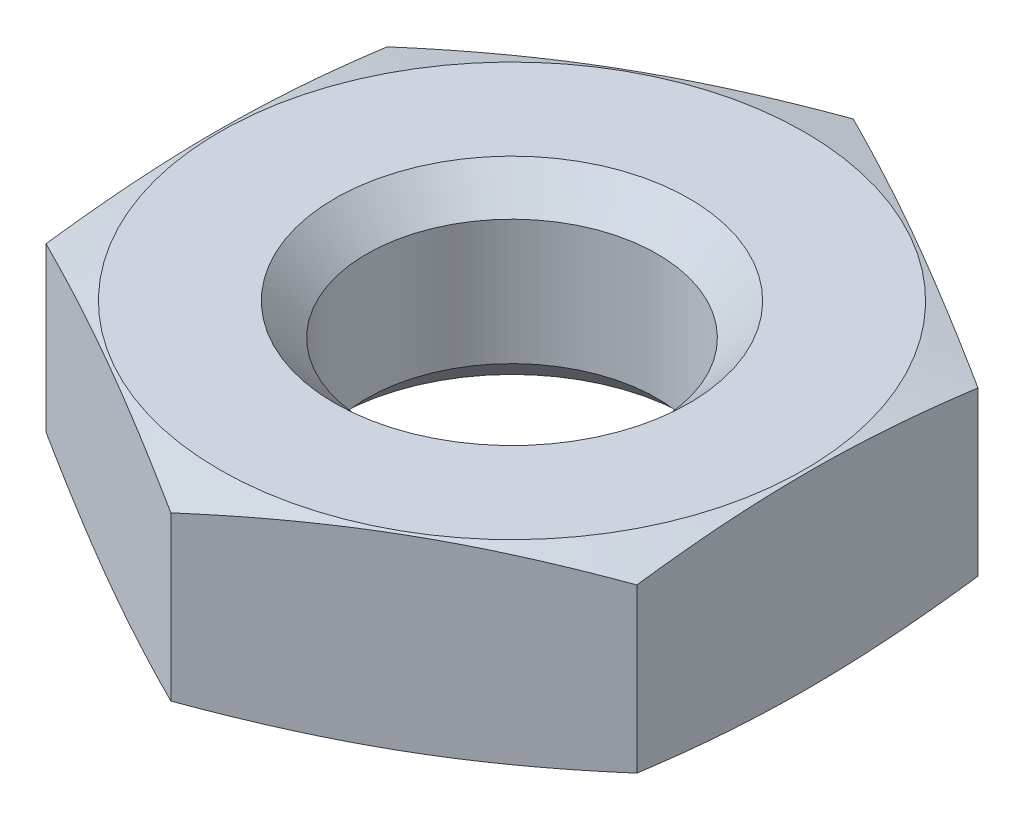
ISO-10303-21;
HEADER;
FILE_DESCRIPTION(('STEP AP214'),'2;1');
FILE_NAME('part.step','',(''),(''),'','','');
FILE_SCHEMA(('AUTOMOTIVE_DESIGN { 1 0 10303 214 1 1 1 1 }'));
ENDSEC;
DATA;
#1=APPLICATION_CONTEXT('core data for automotive mechanical design processes');
#2=APPLICATION_PROTOCOL_DEFINITION('international standard','automotive_design',2000,#1);
#3=PRODUCT_CONTEXT('',#1,'mechanical');
#4=PRODUCT('Part','Part','',(#3));
#5=PRODUCT_RELATED_PRODUCT_CATEGORY('part','',(#4));
#6=PRODUCT_DEFINITION_FORMATION('','',#4);
#7=PRODUCT_DEFINITION_CONTEXT('part definition',#1,'design');
#8=PRODUCT_DEFINITION('design','',#6,#7);
#9=PRODUCT_DEFINITION_SHAPE('','',#8);
#10=(LENGTH_UNIT() NAMED_UNIT(*) SI_UNIT(.MILLI.,.METRE.));
#11=(NAMED_UNIT(*) PLANE_ANGLE_UNIT() SI_UNIT($,.RADIAN.));
#12=(NAMED_UNIT(*) SI_UNIT($,.STERADIAN.) SOLID_ANGLE_UNIT());
#13=UNCERTAINTY_MEASURE_WITH_UNIT(LENGTH_MEASURE(1.E-05),#10,'distance_accuracy_value','');
#14=(GEOMETRIC_REPRESENTATION_CONTEXT(3) GLOBAL_UNCERTAINTY_ASSIGNED_CONTEXT((#13)) GLOBAL_UNIT_ASSIGNED_CONTEXT((#10,
#11,#12)) REPRESENTATION_CONTEXT('',''));
#15=CARTESIAN_POINT('',(0.,0.,0.));
#16=DIRECTION('',(0.,0.,1.));
#17=DIRECTION('',(1.,0.,0.));
#18=AXIS2_PLACEMENT_3D('',#15,#16,#17);
#19=CARTESIAN_POINT('',(0.,0.,0.));
#20=DIRECTION('',(0.,1.,0.));
#21=DIRECTION('',(0.,0.,1.));
#22=AXIS2_PLACEMENT_3D('',#19,#20,#21);
#23=PLANE('',#22);
#24=CARTESIAN_POINT('',(0.,0.,0.));
#25=DIRECTION('',(0.,1.,0.));
#26=DIRECTION('',(0.,0.,1.));
#27=AXIS2_PLACEMENT_3D('',#24,#25,#26);
#28=CIRCLE('',#27,3.);
#29=CARTESIAN_POINT('',(0.,0.,3.));
#30=VERTEX_POINT('',#29);
#31=EDGE_CURVE('E104',#30,#30,#28,.T.);
#32=ORIENTED_EDGE('',*,*,#31,.F.);
#33=EDGE_LOOP('',(#32));
#34=FACE_BOUND('',#33,.T.);
#35=CARTESIAN_POINT('',(0.,0.,0.));
#36=DIRECTION('',(0.,-1.,0.));
#37=DIRECTION('',(0.,0.,-1.));
#38=AXIS2_PLACEMENT_3D('',#35,#36,#37);
#39=CIRCLE('',#38,4.95);
#40=CARTESIAN_POINT('',(0.,0.,-4.95));
#41=VERTEX_POINT('',#40);
#42=EDGE_CURVE('E95',#41,#41,#39,.T.);
#43=ORIENTED_EDGE('',*,*,#42,.F.);
#44=EDGE_LOOP('',(#43));
#45=FACE_BOUND('',#44,.T.);
#46=ADVANCED_FACE('F35',(#34,#45),#23,.T.);
#47=CARTESIAN_POINT('',(0.,-1.6,0.));
#48=DIRECTION('',(0.,-1.,0.));
#49=DIRECTION('',(0.,0.,-1.));
#50=AXIS2_PLACEMENT_3D('',#47,#48,#49);
#51=CONICAL_SURFACE('',#50,10.9212812921102,1.30899693899575);
#52=CARTESIAN_POINT('',(-5.,-1.40384045121828,8.87805586292439));
#53=CARTESIAN_POINT('',(-5.,-1.35391797525742,8.66419967998421));
#54=CARTESIAN_POINT('',(-5.,-1.30439543780652,8.45024946734596));
#55=CARTESIAN_POINT('',(-5.,-1.20633084662231,8.02212108338699));
#56=CARTESIAN_POINT('',(-5.,-1.15778880821914,7.80794290855711));
#57=CARTESIAN_POINT('',(-5.,-1.0618587798065,7.37928689321625));
#58=CARTESIAN_POINT('',(-5.,-1.01447099861738,7.16480900579625));
#59=CARTESIAN_POINT('',(-5.,-0.92110454168024,6.73554876389549));
#60=CARTESIAN_POINT('',(-5.,-0.875125861507366,6.52076641037302));
#61=CARTESIAN_POINT('',(-5.,-0.738830474842199,5.87168350632895));
#62=CARTESIAN_POINT('',(-5.,-0.651101139562341,5.43682759426054));
#63=CARTESIAN_POINT('',(-5.,-0.527234018952879,4.78304799504558));
#64=CARTESIAN_POINT('',(-5.,-0.48723027981153,4.56485695124602));
#65=CARTESIAN_POINT('',(-5.,-0.410417596666629,4.12791523501558));
#66=CARTESIAN_POINT('',(-5.,-0.373608568199298,3.90916457753763));
#67=CARTESIAN_POINT('',(-5.,-0.304856947723479,3.477061393467));
#68=CARTESIAN_POINT('',(-5.,-0.272808368510456,3.26372584152725));
#69=CARTESIAN_POINT('',(-5.,-0.213182881264414,2.83642164400753));
#70=CARTESIAN_POINT('',(-5.,-0.18560604037634,2.62245298897036));
#71=CARTESIAN_POINT('',(-5.,-0.135784090940788,2.19394231946795));
#72=CARTESIAN_POINT('',(-5.,-0.113537665546939,1.97940045987965));
#73=CARTESIAN_POINT('',(-5.,-0.0752280510190547,1.54977294154379));
#74=CARTESIAN_POINT('',(-5.,-0.0591644215455117,1.33468732262148));
#75=CARTESIAN_POINT('',(-5.,-0.0340170523392007,0.905077197521867));
#76=CARTESIAN_POINT('',(-5.,-0.0249020985371091,0.690554548014879));
#77=CARTESIAN_POINT('',(-5.,-0.0140044500352038,0.261321216211934));
#78=CARTESIAN_POINT('',(-5.,-0.0122217093359192,0.0466105351040659));
#79=CARTESIAN_POINT('',(-5.,-0.0160866220181523,-0.382757110763415));
#80=CARTESIAN_POINT('',(-5.,-0.0217347557175591,-0.597414071153564));
#81=CARTESIAN_POINT('',(-5.,-0.0401569999047294,-1.02641477561922));
#82=CARTESIAN_POINT('',(-5.,-0.0529311113199373,-1.24075851965396));
#83=CARTESIAN_POINT('',(-5.,-0.0921734050345291,-1.76492980573846));
#84=CARTESIAN_POINT('',(-5.,-0.122213283058432,-2.0744900323219));
#85=CARTESIAN_POINT('',(-5.,-0.193430880028108,-2.69227880880446));
#86=CARTESIAN_POINT('',(-5.,-0.234608339742622,-3.0005073895285));
#87=CARTESIAN_POINT('',(-5.,-0.325711024028119,-3.61670104233183));
#88=CARTESIAN_POINT('',(-5.,-0.375665000650182,-3.92466179749607));
#89=CARTESIAN_POINT('',(-5.,-0.482092583837901,-4.53945702482084));
#90=CARTESIAN_POINT('',(-5.,-0.538566529999179,-4.84629143745569));
#91=CARTESIAN_POINT('',(-5.,-0.657638370362325,-5.46550091451042));
#92=CARTESIAN_POINT('',(-5.,-0.720340599855474,-5.77785575853689));
#93=CARTESIAN_POINT('',(-5.,-0.849551314942411,-6.40177665533053));
#94=CARTESIAN_POINT('',(-5.,-0.91605984784295,-6.71334269824377));
#95=CARTESIAN_POINT('',(-5.,-1.05155633698141,-7.33405736567034));
#96=CARTESIAN_POINT('',(-5.,-1.12052785519265,-7.64320959550048));
#97=CARTESIAN_POINT('',(-5.,-1.26068096907521,-8.26099002626834));
#98=CARTESIAN_POINT('',(-5.,-1.33186240507047,-8.56961826337515));
#99=CARTESIAN_POINT('',(-5.,-1.40384045121828,-8.87805586292439));
#100=B_SPLINE_CURVE_WITH_KNOTS('',3,(#52,#53,#54,#55,#56,#57,#58,#59,#60,#61,#62,#63,#64,#65,
#66,#67,#68,#69,#70,#71,#72,#73,#74,#75,#76,#77,#78,#79,#80,#81,#82,#83,#84,#85,#86,#87,#88,#89,
#90,#91,#92,#93,#94,#95,#96,#97,#98,#99),.UNSPECIFIED.,.F.,.F.,(4,2,2,2,2,2,2,2,2,2,2,2,2,2,2,2,
2,2,2,2,2,2,2,4),(0.,0.658817958258114,1.31764620921149,1.9765927786871,2.63553727873193,
3.96628445730603,4.63175058893382,5.29719912118488,5.94434851429525,6.59150762371396,
7.23850669123405,7.88545967086849,8.52948907105178,9.17351443083736,9.81758142126871,
10.4616484955253,11.3944203328512,12.3271704614417,13.2630353012496,14.1989489080193,
15.1546761010961,16.1104151750364,17.060663933496,18.0108441914634),.UNSPECIFIED.);
#101=CARTESIAN_POINT('',(-5.,-0.220656881258457,2.88675134594813));
#102=VERTEX_POINT('',#101);
#103=CARTESIAN_POINT('',(-5.,-0.220656881258458,-2.88675134594813));
#104=VERTEX_POINT('',#103);
#105=EDGE_CURVE('E102',#102,#104,#100,.T.);
#106=ORIENTED_EDGE('',*,*,#105,.F.);
#107=CARTESIAN_POINT('',(0.000200000000000026,-0.220687822294318,5.7736181619501));
#108=CARTESIAN_POINT('',(-0.207454004305664,-0.188549555804564,5.65372906666592));
#109=CARTESIAN_POINT('',(-0.415484518325707,-0.159373272644995,5.53362259339679));
#110=CARTESIAN_POINT('',(-0.832280248969818,-0.108113229801612,5.29298546611233));
#111=CARTESIAN_POINT('',(-1.04104572932974,-0.0860323511907198,5.17245465982903));
#112=CARTESIAN_POINT('',(-1.45804559853969,-0.0502522274677517,4.93169967308862));
#113=CARTESIAN_POINT('',(-1.66627716741308,-0.0365103114883428,4.81147712074579));
#114=CARTESIAN_POINT('',(-2.08300586365708,-0.0180838038255036,4.57087869579027));
#115=CARTESIAN_POINT('',(-2.29150293182854,-0.013397459621556,4.45050285735623));
#116=CARTESIAN_POINT('',(-2.70849706817146,-0.0133974596215561,4.20975118048816));
#117=CARTESIAN_POINT('',(-2.91699413634291,-0.0180838038255036,4.08937534205412));
#118=CARTESIAN_POINT('',(-3.33372283258692,-0.0365103114883427,3.8487769170986));
#119=CARTESIAN_POINT('',(-3.54195440146031,-0.0502522274677514,3.72855436475577));
#120=CARTESIAN_POINT('',(-3.95895427067026,-0.0860323511907194,3.48779937801536));
#121=CARTESIAN_POINT('',(-4.16771975103018,-0.108113229801611,3.36726857173206));
#122=CARTESIAN_POINT('',(-4.58451548167429,-0.159373272644995,3.1266314444476));
#123=CARTESIAN_POINT('',(-4.79254599569433,-0.188549555804563,3.00652497117847));
#124=CARTESIAN_POINT('',(-5.0002,-0.220687822294318,2.88663587589429));
#125=B_SPLINE_CURVE_WITH_KNOTS('',3,(#107,#108,#109,#110,#111,#112,#113,#114,#115,#116,#117,
#118,#119,#120,#121,#122,#123,#124),.UNSPECIFIED.,.F.,.F.,(4,2,2,2,2,2,2,2,4),(0.,
0.725805237679808,1.45190481561532,2.17425686883392,2.89646911159516,3.6186813543564,
4.34103340757501,5.06713298551051,5.79293822319032),.UNSPECIFIED.);
#126=CARTESIAN_POINT('',(0.,-0.220656881258458,5.77350269189626));
#127=VERTEX_POINT('',#126);
#128=EDGE_CURVE('E139',#127,#102,#125,.T.);
#129=ORIENTED_EDGE('',*,*,#128,.F.);
#130=CARTESIAN_POINT('',(5.0002,-0.220687822294318,2.88663587589429));
#131=CARTESIAN_POINT('',(4.79254599569433,-0.188549555804564,3.00652497117847));
#132=CARTESIAN_POINT('',(4.58451548167429,-0.159373272644995,3.1266314444476));
#133=CARTESIAN_POINT('',(4.16771975103018,-0.108113229801611,3.36726857173206));
#134=CARTESIAN_POINT('',(3.95895427067026,-0.0860323511907194,3.48779937801536));
#135=CARTESIAN_POINT('',(3.54195440146031,-0.0502522274677513,3.72855436475577));
#136=CARTESIAN_POINT('',(3.33372283258692,-0.0365103114883428,3.8487769170986));
#137=CARTESIAN_POINT('',(2.91699413634292,-0.0180838038255038,4.08937534205412));
#138=CARTESIAN_POINT('',(2.70849706817146,-0.0133974596215563,4.20975118048816));
#139=CARTESIAN_POINT('',(2.29150293182854,-0.0133974596215562,4.45050285735623));
#140=CARTESIAN_POINT('',(2.08300586365709,-0.0180838038255036,4.57087869579027));
#141=CARTESIAN_POINT('',(1.66627716741308,-0.0365103114883428,4.81147712074579));
#142=CARTESIAN_POINT('',(1.45804559853969,-0.0502522274677516,4.93169967308862));
#143=CARTESIAN_POINT('',(1.04104572932974,-0.0860323511907198,5.17245465982902));
#144=CARTESIAN_POINT('',(0.832280248969819,-0.108113229801611,5.29298546611233));
#145=CARTESIAN_POINT('',(0.415484518325709,-0.159373272644995,5.53362259339679));
#146=CARTESIAN_POINT('',(0.207454004305666,-0.188549555804564,5.65372906666592));
#147=CARTESIAN_POINT('',(-0.000199999999999064,-0.220687822294318,5.7736181619501));
#148=B_SPLINE_CURVE_WITH_KNOTS('',3,(#130,#131,#132,#133,#134,#135,#136,#137,#138,#139,#140,
#141,#142,#143,#144,#145,#146,#147),.UNSPECIFIED.,.F.,.F.,(4,2,2,2,2,2,2,2,4),(0.,
0.725805237679808,1.45190481561532,2.17425686883392,2.89646911159516,3.6186813543564,
4.34103340757501,5.06713298551051,5.79293822319032),.UNSPECIFIED.);
#149=CARTESIAN_POINT('',(5.,-0.220656881258457,2.88675134594813));
#150=VERTEX_POINT('',#149);
#151=EDGE_CURVE('E146',#150,#127,#148,.T.);
#152=ORIENTED_EDGE('',*,*,#151,.F.);
#153=CARTESIAN_POINT('',(5.,-1.40384045121828,-8.87805586292439));
#154=CARTESIAN_POINT('',(5.,-1.35391797525742,-8.66419967998421));
#155=CARTESIAN_POINT('',(5.,-1.30439543780652,-8.45024946734596));
#156=CARTESIAN_POINT('',(5.,-1.20633084662231,-8.02212108338699));
#157=CARTESIAN_POINT('',(5.,-1.15778880821914,-7.80794290855711));
#158=CARTESIAN_POINT('',(5.,-1.0618587798065,-7.37928689321625));
#159=CARTESIAN_POINT('',(5.,-1.01447099861738,-7.16480900579625));
#160=CARTESIAN_POINT('',(5.,-0.92110454168024,-6.73554876389549));
#161=CARTESIAN_POINT('',(5.,-0.875125861507366,-6.52076641037302));
#162=CARTESIAN_POINT('',(5.,-0.738830474842199,-5.87168350632895));
#163=CARTESIAN_POINT('',(5.,-0.651101139562341,-5.43682759426054));
#164=CARTESIAN_POINT('',(5.,-0.527234018952879,-4.78304799504558));
#165=CARTESIAN_POINT('',(5.,-0.48723027981153,-4.56485695124602));
#166=CARTESIAN_POINT('',(5.,-0.410417596666629,-4.12791523501558));
#167=CARTESIAN_POINT('',(5.,-0.373608568199298,-3.90916457753763));
#168=CARTESIAN_POINT('',(5.,-0.304856947723479,-3.477061393467));
#169=CARTESIAN_POINT('',(5.,-0.272808368510456,-3.26372584152725));
#170=CARTESIAN_POINT('',(5.,-0.213182881264414,-2.83642164400753));
#171=CARTESIAN_POINT('',(5.,-0.18560604037634,-2.62245298897036));
#172=CARTESIAN_POINT('',(5.,-0.135784090940788,-2.19394231946795));
#173=CARTESIAN_POINT('',(5.,-0.113537665546939,-1.97940045987965));
#174=CARTESIAN_POINT('',(5.,-0.0752280510190547,-1.54977294154379));
#175=CARTESIAN_POINT('',(5.,-0.0591644215455117,-1.33468732262148));
#176=CARTESIAN_POINT('',(5.,-0.0340170523392007,-0.905077197521867));
#177=CARTESIAN_POINT('',(5.,-0.0249020985371091,-0.690554548014879));
#178=CARTESIAN_POINT('',(5.,-0.0140044500352038,-0.261321216211934));
#179=CARTESIAN_POINT('',(5.,-0.0122217093359192,-0.0466105351040659));
#180=CARTESIAN_POINT('',(5.,-0.0160866220181523,0.382757110763415));
#181=CARTESIAN_POINT('',(5.,-0.0217347557175591,0.597414071153564));
#182=CARTESIAN_POINT('',(5.,-0.0401569999047294,1.02641477561922));
#183=CARTESIAN_POINT('',(5.,-0.0529311113199373,1.24075851965396));
#184=CARTESIAN_POINT('',(5.,-0.0921734050345291,1.76492980573846));
#185=CARTESIAN_POINT('',(5.,-0.122213283058432,2.0744900323219));
#186=CARTESIAN_POINT('',(5.,-0.193430880028108,2.69227880880446));
#187=CARTESIAN_POINT('',(5.,-0.234608339742622,3.0005073895285));
#188=CARTESIAN_POINT('',(5.,-0.325711024028119,3.61670104233183));
#189=CARTESIAN_POINT('',(5.,-0.375665000650182,3.92466179749607));
#190=CARTESIAN_POINT('',(5.,-0.482092583837901,4.53945702482084));
#191=CARTESIAN_POINT('',(5.,-0.538566529999179,4.84629143745569));
#192=CARTESIAN_POINT('',(5.,-0.657638370362325,5.46550091451042));
#193=CARTESIAN_POINT('',(5.,-0.720340599855474,5.77785575853689));
#194=CARTESIAN_POINT('',(5.,-0.849551314942411,6.40177665533053));
#195=CARTESIAN_POINT('',(5.,-0.91605984784295,6.71334269824377));
#196=CARTESIAN_POINT('',(5.,-1.05155633698141,7.33405736567034));
#197=CARTESIAN_POINT('',(5.,-1.12052785519265,7.64320959550048));
#198=CARTESIAN_POINT('',(5.,-1.26068096907521,8.26099002626834));
#199=CARTESIAN_POINT('',(5.,-1.33186240507047,8.56961826337515));
#200=CARTESIAN_POINT('',(5.,-1.40384045121828,8.87805586292439));
#201=B_SPLINE_CURVE_WITH_KNOTS('',3,(#153,#154,#155,#156,#157,#158,#159,#160,#161,#162,#163,
#164,#165,#166,#167,#168,#169,#170,#171,#172,#173,#174,#175,#176,#177,#178,#179,#180,#181,#182,
#183,#184,#185,#186,#187,#188,#189,#190,#191,#192,#193,#194,#195,#196,#197,#198,#199,#200),
.UNSPECIFIED.,.F.,.F.,(4,2,2,2,2,2,2,2,2,2,2,2,2,2,2,2,2,2,2,2,2,2,2,4),(0.,0.658817958258114,
1.31764620921149,1.9765927786871,2.63553727873193,3.96628445730603,4.63175058893382,
5.29719912118488,5.94434851429525,6.59150762371396,7.23850669123405,7.88545967086849,
8.52948907105178,9.17351443083736,9.81758142126871,10.4616484955253,11.3944203328512,
12.3271704614417,13.2630353012496,14.1989489080193,15.1546761010961,16.1104151750364,
17.060663933496,18.0108441914634),.UNSPECIFIED.);
#202=CARTESIAN_POINT('',(5.,-0.220656881258457,-2.88675134594813));
#203=VERTEX_POINT('',#202);
#204=EDGE_CURVE('E181',#203,#150,#201,.T.);
#205=ORIENTED_EDGE('',*,*,#204,.F.);
#206=CARTESIAN_POINT('',(-0.000200000000000026,-0.220687822294318,-5.7736181619501));
#207=CARTESIAN_POINT('',(0.207454004305664,-0.188549555804564,-5.65372906666592));
#208=CARTESIAN_POINT('',(0.415484518325707,-0.159373272644995,-5.53362259339679));
#209=CARTESIAN_POINT('',(0.832280248969818,-0.108113229801612,-5.29298546611233));
#210=CARTESIAN_POINT('',(1.04104572932974,-0.0860323511907198,-5.17245465982903));
#211=CARTESIAN_POINT('',(1.45804559853969,-0.0502522274677517,-4.93169967308862));
#212=CARTESIAN_POINT('',(1.66627716741308,-0.0365103114883428,-4.81147712074579));
#213=CARTESIAN_POINT('',(2.08300586365708,-0.0180838038255036,-4.57087869579027));
#214=CARTESIAN_POINT('',(2.29150293182854,-0.013397459621556,-4.45050285735623));
#215=CARTESIAN_POINT('',(2.70849706817146,-0.0133974596215561,-4.20975118048816));
#216=CARTESIAN_POINT('',(2.91699413634291,-0.0180838038255036,-4.08937534205412));
#217=CARTESIAN_POINT('',(3.33372283258692,-0.0365103114883427,-3.8487769170986));
#218=CARTESIAN_POINT('',(3.54195440146031,-0.0502522274677514,-3.72855436475577));
#219=CARTESIAN_POINT('',(3.95895427067026,-0.0860323511907194,-3.48779937801536));
#220=CARTESIAN_POINT('',(4.16771975103018,-0.108113229801611,-3.36726857173206));
#221=CARTESIAN_POINT('',(4.58451548167429,-0.159373272644995,-3.1266314444476));
#222=CARTESIAN_POINT('',(4.79254599569433,-0.188549555804563,-3.00652497117847));
#223=CARTESIAN_POINT('',(5.0002,-0.220687822294318,-2.88663587589429));
#224=B_SPLINE_CURVE_WITH_KNOTS('',3,(#206,#207,#208,#209,#210,#211,#212,#213,#214,#215,#216,
#217,#218,#219,#220,#221,#222,#223),.UNSPECIFIED.,.F.,.F.,(4,2,2,2,2,2,2,2,4),(0.,
0.725805237679808,1.45190481561532,2.17425686883392,2.89646911159516,3.6186813543564,
4.34103340757501,5.06713298551051,5.79293822319032),.UNSPECIFIED.);
#225=CARTESIAN_POINT('',(0.,-0.220656881258458,-5.77350269189626));
#226=VERTEX_POINT('',#225);
#227=EDGE_CURVE('E174',#226,#203,#224,.T.);
#228=ORIENTED_EDGE('',*,*,#227,.F.);
#229=CARTESIAN_POINT('',(-5.0002,-0.220687822294318,-2.88663587589429));
#230=CARTESIAN_POINT('',(-4.79254599569433,-0.188549555804564,-3.00652497117847));
#231=CARTESIAN_POINT('',(-4.58451548167429,-0.159373272644995,-3.1266314444476));
#232=CARTESIAN_POINT('',(-4.16771975103018,-0.108113229801611,-3.36726857173206));
#233=CARTESIAN_POINT('',(-3.95895427067026,-0.0860323511907194,-3.48779937801536));
#234=CARTESIAN_POINT('',(-3.54195440146031,-0.0502522274677513,-3.72855436475577));
#235=CARTESIAN_POINT('',(-3.33372283258692,-0.0365103114883428,-3.8487769170986));
#236=CARTESIAN_POINT('',(-2.91699413634292,-0.0180838038255038,-4.08937534205412));
#237=CARTESIAN_POINT('',(-2.70849706817146,-0.0133974596215563,-4.20975118048816));
#238=CARTESIAN_POINT('',(-2.29150293182854,-0.0133974596215562,-4.45050285735623));
#239=CARTESIAN_POINT('',(-2.08300586365709,-0.0180838038255036,-4.57087869579027));
#240=CARTESIAN_POINT('',(-1.66627716741308,-0.0365103114883428,-4.81147712074579));
#241=CARTESIAN_POINT('',(-1.45804559853969,-0.0502522274677516,-4.93169967308862));
#242=CARTESIAN_POINT('',(-1.04104572932974,-0.0860323511907198,-5.17245465982902));
#243=CARTESIAN_POINT('',(-0.832280248969819,-0.108113229801611,-5.29298546611233));
#244=CARTESIAN_POINT('',(-0.415484518325709,-0.159373272644995,-5.53362259339679));
#245=CARTESIAN_POINT('',(-0.207454004305666,-0.188549555804564,-5.65372906666592));
#246=CARTESIAN_POINT('',(0.000199999999999064,-0.220687822294318,-5.7736181619501));
#247=B_SPLINE_CURVE_WITH_KNOTS('',3,(#229,#230,#231,#232,#233,#234,#235,#236,#237,#238,#239,
#240,#241,#242,#243,#244,#245,#246),.UNSPECIFIED.,.F.,.F.,(4,2,2,2,2,2,2,2,4),(0.,
0.725805237679808,1.45190481561532,2.17425686883392,2.89646911159516,3.6186813543564,
4.34103340757501,5.06713298551051,5.79293822319032),.UNSPECIFIED.);
#248=EDGE_CURVE('E164',#104,#226,#247,.T.);
#249=ORIENTED_EDGE('',*,*,#248,.F.);
#250=EDGE_LOOP('',(#106,#129,#152,#205,#228,#249));
#251=FACE_BOUND('',#250,.T.);
#252=ORIENTED_EDGE('',*,*,#42,.T.);
#253=EDGE_LOOP('',(#252));
#254=FACE_BOUND('',#253,.T.);
#255=ADVANCED_FACE('F157',(#251,#254),#51,.T.);
#256=CARTESIAN_POINT('',(-5.,4.2,-2.88675134594813));
#257=DIRECTION('',(1.,0.,0.));
#258=DIRECTION('',(0.,0.,-1.));
#259=AXIS2_PLACEMENT_3D('',#256,#257,#258);
#260=PLANE('',#259);
#261=ORIENTED_EDGE('',*,*,#105,.T.);
#262=DIRECTION('',(0.,-1.,0.));
#263=VECTOR('',#262,1.);
#264=CARTESIAN_POINT('',(-5.,4.2,-2.88675134594813));
#265=LINE('',#264,#263);
#266=CARTESIAN_POINT('',(-5.,-2.97934311874154,-2.88675134594813));
#267=VERTEX_POINT('',#266);
#268=EDGE_CURVE('E55',#104,#267,#265,.T.);
#269=ORIENTED_EDGE('',*,*,#268,.T.);
#270=CARTESIAN_POINT('',(-5.,-1.79615954878172,-8.87805586292439));
#271=CARTESIAN_POINT('',(-5.,-1.84608202474258,-8.66419967998421));
#272=CARTESIAN_POINT('',(-5.,-1.89560456219348,-8.45024946734596));
#273=CARTESIAN_POINT('',(-5.,-1.99366915337769,-8.02212108338699));
#274=CARTESIAN_POINT('',(-5.,-2.04221119178085,-7.80794290855711));
#275=CARTESIAN_POINT('',(-5.,-2.1381412201935,-7.37928689321625));
#276=CARTESIAN_POINT('',(-5.,-2.18552900138262,-7.16480900579625));
#277=CARTESIAN_POINT('',(-5.,-2.27889545831976,-6.73554876389549));
#278=CARTESIAN_POINT('',(-5.,-2.32487413849263,-6.52076641037302));
#279=CARTESIAN_POINT('',(-5.,-2.4611695251578,-5.87168350632895));
#280=CARTESIAN_POINT('',(-5.,-2.54889886043766,-5.43682759426054));
#281=CARTESIAN_POINT('',(-5.,-2.67276598104712,-4.78304799504558));
#282=CARTESIAN_POINT('',(-5.,-2.71276972018847,-4.56485695124602));
#283=CARTESIAN_POINT('',(-5.,-2.78958240333337,-4.12791523501558));
#284=CARTESIAN_POINT('',(-5.,-2.8263914318007,-3.90916457753763));
#285=CARTESIAN_POINT('',(-5.,-2.89514305227652,-3.477061393467));
#286=CARTESIAN_POINT('',(-5.,-2.92719163148954,-3.26372584152725));
#287=CARTESIAN_POINT('',(-5.,-2.98681711873559,-2.83642164400753));
#288=CARTESIAN_POINT('',(-5.,-3.01439395962366,-2.62245298897036));
#289=CARTESIAN_POINT('',(-5.,-3.06421590905921,-2.19394231946795));
#290=CARTESIAN_POINT('',(-5.,-3.08646233445306,-1.97940045987965));
#291=CARTESIAN_POINT('',(-5.,-3.12477194898094,-1.54977294154379));
#292=CARTESIAN_POINT('',(-5.,-3.14083557845449,-1.33468732262147));
#293=CARTESIAN_POINT('',(-5.,-3.1659829476608,-0.905077197521867));
#294=CARTESIAN_POINT('',(-5.,-3.17509790146289,-0.690554548014879));
#295=CARTESIAN_POINT('',(-5.,-3.1859955499648,-0.261321216211934));
#296=CARTESIAN_POINT('',(-5.,-3.18777829066408,-0.0466105351040659));
#297=CARTESIAN_POINT('',(-5.,-3.18391337798185,0.382757110763415));
#298=CARTESIAN_POINT('',(-5.,-3.17826524428244,0.597414071153564));
#299=CARTESIAN_POINT('',(-5.,-3.15984300009527,1.02641477561922));
#300=CARTESIAN_POINT('',(-5.,-3.14706888868006,1.24075851965396));
#301=CARTESIAN_POINT('',(-5.,-3.10782659496547,1.76492980573846));
#302=CARTESIAN_POINT('',(-5.,-3.07778671694157,2.0744900323219));
#303=CARTESIAN_POINT('',(-5.,-3.00656911997189,2.69227880880447));
#304=CARTESIAN_POINT('',(-5.,-2.96539166025738,3.0005073895285));
#305=CARTESIAN_POINT('',(-5.,-2.87428897597188,3.61670104233183));
#306=CARTESIAN_POINT('',(-5.,-2.82433499934982,3.92466179749607));
#307=CARTESIAN_POINT('',(-5.,-2.7179074161621,4.53945702482084));
#308=CARTESIAN_POINT('',(-5.,-2.66143347000082,4.84629143745569));
#309=CARTESIAN_POINT('',(-5.,-2.54236162963767,5.46550091451042));
#310=CARTESIAN_POINT('',(-5.,-2.47965940014453,5.77785575853689));
#311=CARTESIAN_POINT('',(-5.,-2.35044868505759,6.40177665533053));
#312=CARTESIAN_POINT('',(-5.,-2.28394015215705,6.71334269824377));
#313=CARTESIAN_POINT('',(-5.,-2.14844366301859,7.33405736567034));
#314=CARTESIAN_POINT('',(-5.,-2.07947214480735,7.64320959550048));
#315=CARTESIAN_POINT('',(-5.,-1.93931903092479,8.26099002626834));
#316=CARTESIAN_POINT('',(-5.,-1.86813759492953,8.56961826337515));
#317=CARTESIAN_POINT('',(-5.,-1.79615954878172,8.87805586292439));
#318=B_SPLINE_CURVE_WITH_KNOTS('',3,(#270,#271,#272,#273,#274,#275,#276,#277,#278,#279,#280,
#281,#282,#283,#284,#285,#286,#287,#288,#289,#290,#291,#292,#293,#294,#295,#296,#297,#298,#299,
#300,#301,#302,#303,#304,#305,#306,#307,#308,#309,#310,#311,#312,#313,#314,#315,#316,#317),
.UNSPECIFIED.,.F.,.F.,(4,2,2,2,2,2,2,2,2,2,2,2,2,2,2,2,2,2,2,2,2,2,2,4),(0.,0.658817958258114,
1.31764620921149,1.9765927786871,2.63553727873193,3.96628445730603,4.63175058893381,
5.29719912118488,5.94434851429525,6.59150762371396,7.23850669123405,7.88545967086849,
8.52948907105178,9.17351443083736,9.81758142126871,10.4616484955253,11.3944203328512,
12.3271704614417,13.2630353012496,14.1989489080193,15.1546761010961,16.1104151750364,
17.060663933496,18.0108441914634),.UNSPECIFIED.);
#319=CARTESIAN_POINT('',(-5.,-2.97934311874154,2.88675134594813));
#320=VERTEX_POINT('',#319);
#321=EDGE_CURVE('E11',#267,#320,#318,.T.);
#322=ORIENTED_EDGE('',*,*,#321,.T.);
#323=DIRECTION('',(0.,-1.,0.));
#324=VECTOR('',#323,1.);
#325=CARTESIAN_POINT('',(-5.,4.2,2.88675134594813));
#326=LINE('',#325,#324);
#327=EDGE_CURVE('E267',#102,#320,#326,.T.);
#328=ORIENTED_EDGE('',*,*,#327,.F.);
#329=EDGE_LOOP('',(#261,#269,#322,#328));
#330=FACE_BOUND('',#329,.T.);
#331=ADVANCED_FACE('F98',(#330),#260,.F.);
#332=CARTESIAN_POINT('',(-5.,4.2,2.88675134594813));
#333=DIRECTION('',(0.5,0.,-0.866025403784438));
#334=DIRECTION('',(-0.866025403784439,0.,-0.5));
#335=AXIS2_PLACEMENT_3D('',#332,#333,#334);
#336=PLANE('',#335);
#337=ORIENTED_EDGE('',*,*,#128,.T.);
#338=ORIENTED_EDGE('',*,*,#327,.T.);
#339=CARTESIAN_POINT('',(-5.0002,-2.97931217770568,2.88663587589429));
#340=CARTESIAN_POINT('',(-4.79254599569433,-3.01145044419544,3.00652497117847));
#341=CARTESIAN_POINT('',(-4.58451548167429,-3.040626727355,3.1266314444476));
#342=CARTESIAN_POINT('',(-4.16771975103018,-3.09188677019839,3.36726857173206));
#343=CARTESIAN_POINT('',(-3.95895427067026,-3.11396764880928,3.48779937801536));
#344=CARTESIAN_POINT('',(-3.54195440146031,-3.14974777253225,3.72855436475577));
#345=CARTESIAN_POINT('',(-3.33372283258692,-3.16348968851166,3.8487769170986));
#346=CARTESIAN_POINT('',(-2.91699413634292,-3.1819161961745,4.08937534205412));
#347=CARTESIAN_POINT('',(-2.70849706817146,-3.18660254037844,4.20975118048816));
#348=CARTESIAN_POINT('',(-2.29150293182854,-3.18660254037844,4.45050285735623));
#349=CARTESIAN_POINT('',(-2.08300586365709,-3.1819161961745,4.57087869579027));
#350=CARTESIAN_POINT('',(-1.66627716741308,-3.16348968851166,4.81147712074579));
#351=CARTESIAN_POINT('',(-1.45804559853969,-3.14974777253225,4.93169967308862));
#352=CARTESIAN_POINT('',(-1.04104572932974,-3.11396764880928,5.17245465982903));
#353=CARTESIAN_POINT('',(-0.832280248969819,-3.09188677019839,5.29298546611233));
#354=CARTESIAN_POINT('',(-0.415484518325708,-3.040626727355,5.53362259339679));
#355=CARTESIAN_POINT('',(-0.207454004305665,-3.01145044419544,5.65372906666592));
#356=CARTESIAN_POINT('',(0.000199999999999278,-2.97931217770568,5.7736181619501));
#357=B_SPLINE_CURVE_WITH_KNOTS('',3,(#339,#340,#341,#342,#343,#344,#345,#346,#347,#348,#349,
#350,#351,#352,#353,#354,#355,#356),.UNSPECIFIED.,.F.,.F.,(4,2,2,2,2,2,2,2,4),(0.,
0.725805237679808,1.45190481561532,2.17425686883392,2.89646911159516,3.6186813543564,
4.34103340757501,5.06713298551051,5.79293822319032),.UNSPECIFIED.);
#358=CARTESIAN_POINT('',(0.,-2.97934311874154,5.77350269189626));
#359=VERTEX_POINT('',#358);
#360=EDGE_CURVE('E48',#320,#359,#357,.T.);
#361=ORIENTED_EDGE('',*,*,#360,.T.);
#362=DIRECTION('',(0.,-1.,0.));
#363=VECTOR('',#362,1.);
#364=CARTESIAN_POINT('',(0.,4.2,5.77350269189626));
#365=LINE('',#364,#363);
#366=EDGE_CURVE('E266',#127,#359,#365,.T.);
#367=ORIENTED_EDGE('',*,*,#366,.F.);
#368=EDGE_LOOP('',(#337,#338,#361,#367));
#369=FACE_BOUND('',#368,.T.);
#370=ADVANCED_FACE('F130',(#369),#336,.F.);
#371=CARTESIAN_POINT('',(0.,4.2,5.77350269189626));
#372=DIRECTION('',(-0.5,0.,-0.866025403784438));
#373=DIRECTION('',(-0.866025403784439,0.,0.5));
#374=AXIS2_PLACEMENT_3D('',#371,#372,#373);
#375=PLANE('',#374);
#376=ORIENTED_EDGE('',*,*,#151,.T.);
#377=ORIENTED_EDGE('',*,*,#366,.T.);
#378=CARTESIAN_POINT('',(-0.000200000000000035,-2.97931217770568,5.7736181619501));
#379=CARTESIAN_POINT('',(0.207454004305664,-3.01145044419544,5.65372906666592));
#380=CARTESIAN_POINT('',(0.415484518325707,-3.040626727355,5.53362259339679));
#381=CARTESIAN_POINT('',(0.832280248969818,-3.09188677019839,5.29298546611233));
#382=CARTESIAN_POINT('',(1.04104572932974,-3.11396764880928,5.17245465982903));
#383=CARTESIAN_POINT('',(1.45804559853969,-3.14974777253225,4.93169967308862));
#384=CARTESIAN_POINT('',(1.66627716741308,-3.16348968851166,4.81147712074579));
#385=CARTESIAN_POINT('',(2.08300586365708,-3.1819161961745,4.57087869579027));
#386=CARTESIAN_POINT('',(2.29150293182854,-3.18660254037844,4.45050285735623));
#387=CARTESIAN_POINT('',(2.70849706817146,-3.18660254037844,4.20975118048816));
#388=CARTESIAN_POINT('',(2.91699413634291,-3.1819161961745,4.08937534205412));
#389=CARTESIAN_POINT('',(3.33372283258692,-3.16348968851166,3.8487769170986));
#390=CARTESIAN_POINT('',(3.54195440146031,-3.14974777253225,3.72855436475577));
#391=CARTESIAN_POINT('',(3.95895427067026,-3.11396764880928,3.48779937801536));
#392=CARTESIAN_POINT('',(4.16771975103018,-3.09188677019839,3.36726857173206));
#393=CARTESIAN_POINT('',(4.58451548167429,-3.04062672735501,3.1266314444476));
#394=CARTESIAN_POINT('',(4.79254599569433,-3.01145044419544,3.00652497117847));
#395=CARTESIAN_POINT('',(5.0002,-2.97931217770568,2.88663587589429));
#396=B_SPLINE_CURVE_WITH_KNOTS('',3,(#378,#379,#380,#381,#382,#383,#384,#385,#386,#387,#388,
#389,#390,#391,#392,#393,#394,#395),.UNSPECIFIED.,.F.,.F.,(4,2,2,2,2,2,2,2,4),(0.,
0.725805237679807,1.45190481561532,2.17425686883392,2.89646911159516,3.6186813543564,
4.34103340757501,5.06713298551051,5.79293822319032),.UNSPECIFIED.);
#397=CARTESIAN_POINT('',(5.,-2.97934311874154,2.88675134594813));
#398=VERTEX_POINT('',#397);
#399=EDGE_CURVE('E111',#359,#398,#396,.T.);
#400=ORIENTED_EDGE('',*,*,#399,.T.);
#401=DIRECTION('',(0.,-1.,0.));
#402=VECTOR('',#401,1.);
#403=CARTESIAN_POINT('',(5.,4.2,2.88675134594813));
#404=LINE('',#403,#402);
#405=EDGE_CURVE('E263',#150,#398,#404,.T.);
#406=ORIENTED_EDGE('',*,*,#405,.F.);
#407=EDGE_LOOP('',(#376,#377,#400,#406));
#408=FACE_BOUND('',#407,.T.);
#409=ADVANCED_FACE('F133',(#408),#375,.F.);
#410=CARTESIAN_POINT('',(5.,4.2,2.88675134594813));
#411=DIRECTION('',(-1.,0.,0.));
#412=DIRECTION('',(0.,0.,1.));
#413=AXIS2_PLACEMENT_3D('',#410,#411,#412);
#414=PLANE('',#413);
#415=ORIENTED_EDGE('',*,*,#204,.T.);
#416=ORIENTED_EDGE('',*,*,#405,.T.);
#417=CARTESIAN_POINT('',(5.,-1.79615954878172,8.87805586292439));
#418=CARTESIAN_POINT('',(5.,-1.84608202474258,8.66419967998421));
#419=CARTESIAN_POINT('',(5.,-1.89560456219348,8.45024946734596));
#420=CARTESIAN_POINT('',(5.,-1.99366915337769,8.02212108338699));
#421=CARTESIAN_POINT('',(5.,-2.04221119178085,7.80794290855711));
#422=CARTESIAN_POINT('',(5.,-2.1381412201935,7.37928689321625));
#423=CARTESIAN_POINT('',(5.,-2.18552900138262,7.16480900579625));
#424=CARTESIAN_POINT('',(5.,-2.27889545831976,6.73554876389549));
#425=CARTESIAN_POINT('',(5.,-2.32487413849263,6.52076641037302));
#426=CARTESIAN_POINT('',(5.,-2.4611695251578,5.87168350632895));
#427=CARTESIAN_POINT('',(5.,-2.54889886043766,5.43682759426054));
#428=CARTESIAN_POINT('',(5.,-2.67276598104712,4.78304799504558));
#429=CARTESIAN_POINT('',(5.,-2.71276972018847,4.56485695124602));
#430=CARTESIAN_POINT('',(5.,-2.78958240333337,4.12791523501558));
#431=CARTESIAN_POINT('',(5.,-2.8263914318007,3.90916457753763));
#432=CARTESIAN_POINT('',(5.,-2.89514305227652,3.477061393467));
#433=CARTESIAN_POINT('',(5.,-2.92719163148954,3.26372584152725));
#434=CARTESIAN_POINT('',(5.,-2.98681711873559,2.83642164400753));
#435=CARTESIAN_POINT('',(5.,-3.01439395962366,2.62245298897036));
#436=CARTESIAN_POINT('',(5.,-3.06421590905921,2.19394231946795));
#437=CARTESIAN_POINT('',(5.,-3.08646233445306,1.97940045987965));
#438=CARTESIAN_POINT('',(5.,-3.12477194898094,1.54977294154379));
#439=CARTESIAN_POINT('',(5.,-3.14083557845449,1.33468732262147));
#440=CARTESIAN_POINT('',(5.,-3.1659829476608,0.905077197521867));
#441=CARTESIAN_POINT('',(5.,-3.17509790146289,0.690554548014879));
#442=CARTESIAN_POINT('',(5.,-3.1859955499648,0.261321216211934));
#443=CARTESIAN_POINT('',(5.,-3.18777829066408,0.0466105351040659));
#444=CARTESIAN_POINT('',(5.,-3.18391337798185,-0.382757110763415));
#445=CARTESIAN_POINT('',(5.,-3.17826524428244,-0.597414071153564));
#446=CARTESIAN_POINT('',(5.,-3.15984300009527,-1.02641477561922));
#447=CARTESIAN_POINT('',(5.,-3.14706888868006,-1.24075851965396));
#448=CARTESIAN_POINT('',(5.,-3.10782659496547,-1.76492980573846));
#449=CARTESIAN_POINT('',(5.,-3.07778671694157,-2.0744900323219));
#450=CARTESIAN_POINT('',(5.,-3.00656911997189,-2.69227880880447));
#451=CARTESIAN_POINT('',(5.,-2.96539166025738,-3.0005073895285));
#452=CARTESIAN_POINT('',(5.,-2.87428897597188,-3.61670104233183));
#453=CARTESIAN_POINT('',(5.,-2.82433499934982,-3.92466179749607));
#454=CARTESIAN_POINT('',(5.,-2.7179074161621,-4.53945702482084));
#455=CARTESIAN_POINT('',(5.,-2.66143347000082,-4.84629143745569));
#456=CARTESIAN_POINT('',(5.,-2.54236162963767,-5.46550091451042));
#457=CARTESIAN_POINT('',(5.,-2.47965940014453,-5.77785575853689));
#458=CARTESIAN_POINT('',(5.,-2.35044868505759,-6.40177665533053));
#459=CARTESIAN_POINT('',(5.,-2.28394015215705,-6.71334269824377));
#460=CARTESIAN_POINT('',(5.,-2.14844366301859,-7.33405736567034));
#461=CARTESIAN_POINT('',(5.,-2.07947214480735,-7.64320959550048));
#462=CARTESIAN_POINT('',(5.,-1.93931903092479,-8.26099002626834));
#463=CARTESIAN_POINT('',(5.,-1.86813759492953,-8.56961826337515));
#464=CARTESIAN_POINT('',(5.,-1.79615954878172,-8.87805586292439));
#465=B_SPLINE_CURVE_WITH_KNOTS('',3,(#417,#418,#419,#420,#421,#422,#423,#424,#425,#426,#427,
#428,#429,#430,#431,#432,#433,#434,#435,#436,#437,#438,#439,#440,#441,#442,#443,#444,#445,#446,
#447,#448,#449,#450,#451,#452,#453,#454,#455,#456,#457,#458,#459,#460,#461,#462,#463,#464),
.UNSPECIFIED.,.F.,.F.,(4,2,2,2,2,2,2,2,2,2,2,2,2,2,2,2,2,2,2,2,2,2,2,4),(0.,0.658817958258114,
1.31764620921149,1.9765927786871,2.63553727873193,3.96628445730603,4.63175058893381,
5.29719912118488,5.94434851429525,6.59150762371396,7.23850669123405,7.88545967086849,
8.52948907105178,9.17351443083736,9.81758142126871,10.4616484955253,11.3944203328512,
12.3271704614417,13.2630353012496,14.1989489080193,15.1546761010961,16.1104151750364,
17.060663933496,18.0108441914634),.UNSPECIFIED.);
#466=CARTESIAN_POINT('',(5.,-2.97934311874154,-2.88675134594813));
#467=VERTEX_POINT('',#466);
#468=EDGE_CURVE('E115',#398,#467,#465,.T.);
#469=ORIENTED_EDGE('',*,*,#468,.T.);
#470=DIRECTION('',(0.,-1.,0.));
#471=VECTOR('',#470,1.);
#472=CARTESIAN_POINT('',(5.,4.2,-2.88675134594813));
#473=LINE('',#472,#471);
#474=EDGE_CURVE('E260',#203,#467,#473,.T.);
#475=ORIENTED_EDGE('',*,*,#474,.F.);
#476=EDGE_LOOP('',(#415,#416,#469,#475));
#477=FACE_BOUND('',#476,.T.);
#478=ADVANCED_FACE('F186',(#477),#414,.F.);
#479=CARTESIAN_POINT('',(5.,4.2,-2.88675134594813));
#480=DIRECTION('',(-0.5,0.,0.866025403784438));
#481=DIRECTION('',(0.866025403784439,0.,0.5));
#482=AXIS2_PLACEMENT_3D('',#479,#480,#481);
#483=PLANE('',#482);
#484=ORIENTED_EDGE('',*,*,#227,.T.);
#485=ORIENTED_EDGE('',*,*,#474,.T.);
#486=CARTESIAN_POINT('',(5.0002,-2.97931217770568,-2.88663587589429));
#487=CARTESIAN_POINT('',(4.79254599569433,-3.01145044419544,-3.00652497117847));
#488=CARTESIAN_POINT('',(4.58451548167429,-3.040626727355,-3.1266314444476));
#489=CARTESIAN_POINT('',(4.16771975103018,-3.09188677019839,-3.36726857173206));
#490=CARTESIAN_POINT('',(3.95895427067026,-3.11396764880928,-3.48779937801536));
#491=CARTESIAN_POINT('',(3.54195440146031,-3.14974777253225,-3.72855436475577));
#492=CARTESIAN_POINT('',(3.33372283258692,-3.16348968851166,-3.8487769170986));
#493=CARTESIAN_POINT('',(2.91699413634292,-3.1819161961745,-4.08937534205412));
#494=CARTESIAN_POINT('',(2.70849706817146,-3.18660254037844,-4.20975118048816));
#495=CARTESIAN_POINT('',(2.29150293182854,-3.18660254037844,-4.45050285735623));
#496=CARTESIAN_POINT('',(2.08300586365709,-3.1819161961745,-4.57087869579027));
#497=CARTESIAN_POINT('',(1.66627716741308,-3.16348968851166,-4.81147712074579));
#498=CARTESIAN_POINT('',(1.45804559853969,-3.14974777253225,-4.93169967308862));
#499=CARTESIAN_POINT('',(1.04104572932974,-3.11396764880928,-5.17245465982903));
#500=CARTESIAN_POINT('',(0.832280248969819,-3.09188677019839,-5.29298546611233));
#501=CARTESIAN_POINT('',(0.415484518325708,-3.040626727355,-5.53362259339679));
#502=CARTESIAN_POINT('',(0.207454004305665,-3.01145044419544,-5.65372906666592));
#503=CARTESIAN_POINT('',(-0.000199999999999278,-2.97931217770568,-5.7736181619501));
#504=B_SPLINE_CURVE_WITH_KNOTS('',3,(#486,#487,#488,#489,#490,#491,#492,#493,#494,#495,#496,
#497,#498,#499,#500,#501,#502,#503),.UNSPECIFIED.,.F.,.F.,(4,2,2,2,2,2,2,2,4),(0.,
0.725805237679808,1.45190481561532,2.17425686883392,2.89646911159516,3.6186813543564,
4.34103340757501,5.06713298551051,5.79293822319032),.UNSPECIFIED.);
#505=CARTESIAN_POINT('',(0.,-2.97934311874154,-5.77350269189626));
#506=VERTEX_POINT('',#505);
#507=EDGE_CURVE('E94',#467,#506,#504,.T.);
#508=ORIENTED_EDGE('',*,*,#507,.T.);
#509=DIRECTION('',(0.,-1.,0.));
#510=VECTOR('',#509,1.);
#511=CARTESIAN_POINT('',(0.,4.2,-5.77350269189626));
#512=LINE('',#511,#510);
#513=EDGE_CURVE('E60',#226,#506,#512,.T.);
#514=ORIENTED_EDGE('',*,*,#513,.F.);
#515=EDGE_LOOP('',(#484,#485,#508,#514));
#516=FACE_BOUND('',#515,.T.);
#517=ADVANCED_FACE('F189',(#516),#483,.F.);
#518=CARTESIAN_POINT('',(0.,4.2,-5.77350269189626));
#519=DIRECTION('',(0.5,0.,0.866025403784438));
#520=DIRECTION('',(0.866025403784439,0.,-0.5));
#521=AXIS2_PLACEMENT_3D('',#518,#519,#520);
#522=PLANE('',#521);
#523=ORIENTED_EDGE('',*,*,#248,.T.);
#524=ORIENTED_EDGE('',*,*,#513,.T.);
#525=CARTESIAN_POINT('',(0.000200000000000035,-2.97931217770568,-5.7736181619501));
#526=CARTESIAN_POINT('',(-0.207454004305664,-3.01145044419544,-5.65372906666592));
#527=CARTESIAN_POINT('',(-0.415484518325707,-3.040626727355,-5.53362259339679));
#528=CARTESIAN_POINT('',(-0.832280248969818,-3.09188677019839,-5.29298546611233));
#529=CARTESIAN_POINT('',(-1.04104572932974,-3.11396764880928,-5.17245465982903));
#530=CARTESIAN_POINT('',(-1.45804559853969,-3.14974777253225,-4.93169967308862));
#531=CARTESIAN_POINT('',(-1.66627716741308,-3.16348968851166,-4.81147712074579));
#532=CARTESIAN_POINT('',(-2.08300586365708,-3.1819161961745,-4.57087869579027));
#533=CARTESIAN_POINT('',(-2.29150293182854,-3.18660254037844,-4.45050285735623));
#534=CARTESIAN_POINT('',(-2.70849706817146,-3.18660254037844,-4.20975118048816));
#535=CARTESIAN_POINT('',(-2.91699413634291,-3.1819161961745,-4.08937534205412));
#536=CARTESIAN_POINT('',(-3.33372283258692,-3.16348968851166,-3.8487769170986));
#537=CARTESIAN_POINT('',(-3.54195440146031,-3.14974777253225,-3.72855436475577));
#538=CARTESIAN_POINT('',(-3.95895427067026,-3.11396764880928,-3.48779937801536));
#539=CARTESIAN_POINT('',(-4.16771975103018,-3.09188677019839,-3.36726857173206));
#540=CARTESIAN_POINT('',(-4.58451548167429,-3.04062672735501,-3.1266314444476));
#541=CARTESIAN_POINT('',(-4.79254599569433,-3.01145044419544,-3.00652497117847));
#542=CARTESIAN_POINT('',(-5.0002,-2.97931217770568,-2.88663587589429));
#543=B_SPLINE_CURVE_WITH_KNOTS('',3,(#525,#526,#527,#528,#529,#530,#531,#532,#533,#534,#535,
#536,#537,#538,#539,#540,#541,#542),.UNSPECIFIED.,.F.,.F.,(4,2,2,2,2,2,2,2,4),(0.,
0.725805237679807,1.45190481561532,2.17425686883392,2.89646911159516,3.6186813543564,
4.34103340757501,5.06713298551051,5.79293822319032),.UNSPECIFIED.);
#544=EDGE_CURVE('E89',#506,#267,#543,.T.);
#545=ORIENTED_EDGE('',*,*,#544,.T.);
#546=ORIENTED_EDGE('',*,*,#268,.F.);
#547=EDGE_LOOP('',(#523,#524,#545,#546));
#548=FACE_BOUND('',#547,.T.);
#549=ADVANCED_FACE('F90',(#548),#522,.F.);
#550=CARTESIAN_POINT('',(4.95,-3.2,0.));
#551=DIRECTION('',(0.,-1.,0.));
#552=DIRECTION('',(0.,0.,-1.));
#553=AXIS2_PLACEMENT_3D('',#550,#551,#552);
#554=PLANE('',#553);
#555=CARTESIAN_POINT('',(0.,-3.2,0.));
#556=DIRECTION('',(0.,1.,0.));
#557=DIRECTION('',(0.,0.,1.));
#558=AXIS2_PLACEMENT_3D('',#555,#556,#557);
#559=CIRCLE('',#558,3.);
#560=CARTESIAN_POINT('',(0.,-3.2,3.));
#561=VERTEX_POINT('',#560);
#562=EDGE_CURVE('E250',#561,#561,#559,.T.);
#563=ORIENTED_EDGE('',*,*,#562,.T.);
#564=EDGE_LOOP('',(#563));
#565=FACE_BOUND('',#564,.T.);
#566=CARTESIAN_POINT('',(0.,-3.2,0.));
#567=DIRECTION('',(0.,-1.,0.));
#568=DIRECTION('',(0.,0.,-1.));
#569=AXIS2_PLACEMENT_3D('',#566,#567,#568);
#570=CIRCLE('',#569,4.95);
#571=CARTESIAN_POINT('',(0.,-3.2,-4.95));
#572=VERTEX_POINT('',#571);
#573=EDGE_CURVE('E237',#572,#572,#570,.T.);
#574=ORIENTED_EDGE('',*,*,#573,.T.);
#575=EDGE_LOOP('',(#574));
#576=FACE_BOUND('',#575,.T.);
#577=ADVANCED_FACE('F210',(#565,#576),#554,.T.);
#578=CARTESIAN_POINT('',(0.,-3.2,0.));
#579=DIRECTION('',(0.,1.,0.));
#580=DIRECTION('',(0.,0.,1.));
#581=AXIS2_PLACEMENT_3D('',#578,#579,#580);
#582=CONICAL_SURFACE('',#581,4.95,1.30899693899575);
#583=ORIENTED_EDGE('',*,*,#321,.F.);
#584=ORIENTED_EDGE('',*,*,#544,.F.);
#585=ORIENTED_EDGE('',*,*,#507,.F.);
#586=ORIENTED_EDGE('',*,*,#468,.F.);
#587=ORIENTED_EDGE('',*,*,#399,.F.);
#588=ORIENTED_EDGE('',*,*,#360,.F.);
#589=EDGE_LOOP('',(#583,#584,#585,#586,#587,#588));
#590=FACE_BOUND('',#589,.T.);
#591=ORIENTED_EDGE('',*,*,#573,.F.);
#592=EDGE_LOOP('',(#591));
#593=FACE_BOUND('',#592,.T.);
#594=ADVANCED_FACE('F107',(#590,#593),#582,.T.);
#595=CARTESIAN_POINT('',(0.,-0.5415,0.));
#596=DIRECTION('',(0.,1.,0.));
#597=DIRECTION('',(0.,0.,1.));
#598=AXIS2_PLACEMENT_3D('',#595,#596,#597);
#599=CONICAL_SURFACE('',#598,2.4585,0.785398163397448);
#600=ORIENTED_EDGE('',*,*,#31,.T.);
#601=EDGE_LOOP('',(#600));
#602=FACE_BOUND('',#601,.T.);
#603=CARTESIAN_POINT('',(0.,-0.5415,0.));
#604=DIRECTION('',(0.,1.,0.));
#605=DIRECTION('',(0.,0.,1.));
#606=AXIS2_PLACEMENT_3D('',#603,#604,#605);
#607=CIRCLE('',#606,2.4585);
#608=CARTESIAN_POINT('',(0.,-0.5415,2.4585));
#609=VERTEX_POINT('',#608);
#610=EDGE_CURVE('E253',#609,#609,#607,.T.);
#611=ORIENTED_EDGE('',*,*,#610,.F.);
#612=EDGE_LOOP('',(#611));
#613=FACE_BOUND('',#612,.T.);
#614=ADVANCED_FACE('F211',(#602,#613),#599,.F.);
#615=CARTESIAN_POINT('',(0.,-3.2,0.));
#616=DIRECTION('',(0.,1.,0.));
#617=DIRECTION('',(0.,0.,1.));
#618=AXIS2_PLACEMENT_3D('',#615,#616,#617);
#619=CYLINDRICAL_SURFACE('',#618,2.4585);
#620=ORIENTED_EDGE('',*,*,#610,.T.);
#621=EDGE_LOOP('',(#620));
#622=FACE_BOUND('',#621,.T.);
#623=CARTESIAN_POINT('',(0.,-2.6585,0.));
#624=DIRECTION('',(0.,1.,0.));
#625=DIRECTION('',(0.,0.,1.));
#626=AXIS2_PLACEMENT_3D('',#623,#624,#625);
#627=CIRCLE('',#626,2.4585);
#628=CARTESIAN_POINT('',(0.,-2.6585,2.4585));
#629=VERTEX_POINT('',#628);
#630=EDGE_CURVE('E251',#629,#629,#627,.T.);
#631=ORIENTED_EDGE('',*,*,#630,.F.);
#632=EDGE_LOOP('',(#631));
#633=FACE_BOUND('',#632,.T.);
#634=ADVANCED_FACE('F215',(#622,#633),#619,.F.);
#635=CARTESIAN_POINT('',(0.,-3.2,0.));
#636=DIRECTION('',(0.,-1.,0.));
#637=DIRECTION('',(0.,0.,-1.));
#638=AXIS2_PLACEMENT_3D('',#635,#636,#637);
#639=CONICAL_SURFACE('',#638,3.,0.785398163397448);
#640=ORIENTED_EDGE('',*,*,#630,.T.);
#641=EDGE_LOOP('',(#640));
#642=FACE_BOUND('',#641,.T.);
#643=ORIENTED_EDGE('',*,*,#562,.F.);
#644=EDGE_LOOP('',(#643));
#645=FACE_BOUND('',#644,.T.);
#646=ADVANCED_FACE('F219',(#642,#645),#639,.F.);
#647=CLOSED_SHELL('',(#46,#255,#331,#370,#409,#478,#517,#549,#577,#594,#614,#634,#646));
#648=MANIFOLD_SOLID_BREP('B2',#647);
#649=ADVANCED_BREP_SHAPE_REPRESENTATION('',(#18,#648),#14);
#650=SHAPE_DEFINITION_REPRESENTATION(#9,#649);
ENDSEC;
END-ISO-10303-21;
